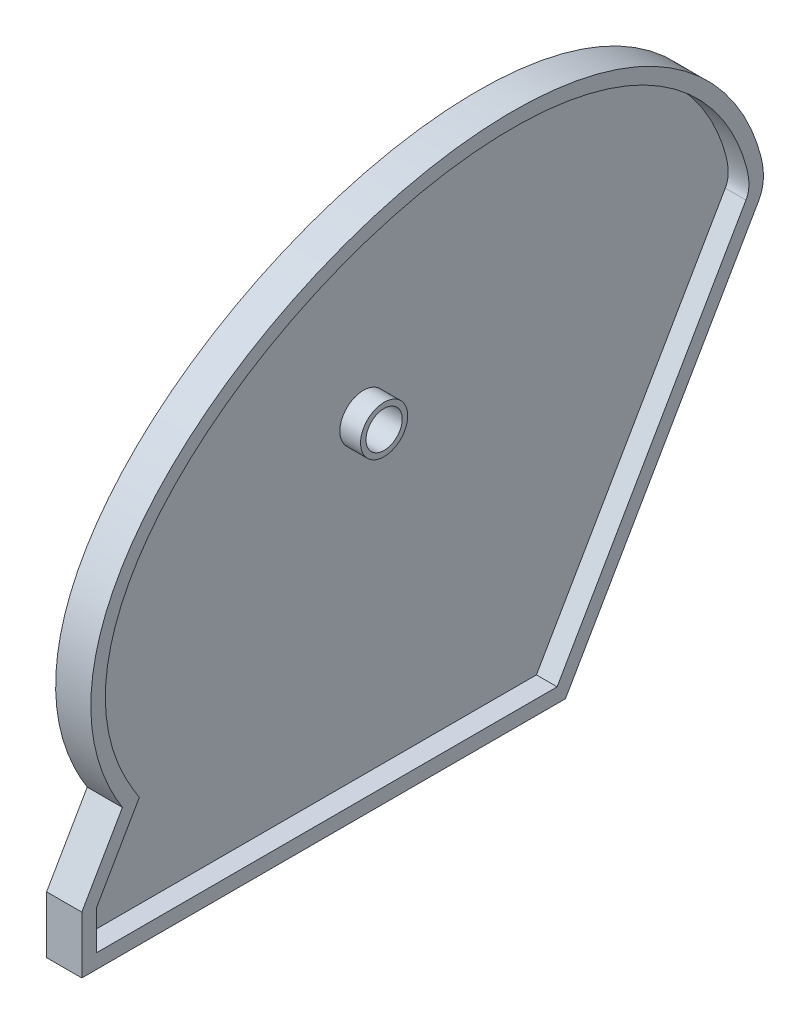
ISO-10303-21;
HEADER;
FILE_DESCRIPTION(('STEP AP214'),'2;1');
FILE_NAME('part.step','',(''),(''),'','','');
FILE_SCHEMA(('AUTOMOTIVE_DESIGN { 1 0 10303 214 1 1 1 1 }'));
ENDSEC;
DATA;
#1=APPLICATION_CONTEXT('core data for automotive mechanical design processes');
#2=APPLICATION_PROTOCOL_DEFINITION('international standard','automotive_design',2000,#1);
#3=PRODUCT_CONTEXT('',#1,'mechanical');
#4=PRODUCT('Part','Part','',(#3));
#5=PRODUCT_RELATED_PRODUCT_CATEGORY('part','',(#4));
#6=PRODUCT_DEFINITION_FORMATION('','',#4);
#7=PRODUCT_DEFINITION_CONTEXT('part definition',#1,'design');
#8=PRODUCT_DEFINITION('design','',#6,#7);
#9=PRODUCT_DEFINITION_SHAPE('','',#8);
#10=(LENGTH_UNIT() NAMED_UNIT(*) SI_UNIT(.MILLI.,.METRE.));
#11=(NAMED_UNIT(*) PLANE_ANGLE_UNIT() SI_UNIT($,.RADIAN.));
#12=(NAMED_UNIT(*) SI_UNIT($,.STERADIAN.) SOLID_ANGLE_UNIT());
#13=UNCERTAINTY_MEASURE_WITH_UNIT(LENGTH_MEASURE(1.E-05),#10,'distance_accuracy_value','');
#14=(GEOMETRIC_REPRESENTATION_CONTEXT(3) GLOBAL_UNCERTAINTY_ASSIGNED_CONTEXT((#13)) GLOBAL_UNIT_ASSIGNED_CONTEXT((#10,
#11,#12)) REPRESENTATION_CONTEXT('',''));
#15=CARTESIAN_POINT('',(0.,0.,0.));
#16=DIRECTION('',(0.,0.,1.));
#17=DIRECTION('',(1.,0.,0.));
#18=AXIS2_PLACEMENT_3D('',#15,#16,#17);
#19=CARTESIAN_POINT('',(0.,71.0497399033929,29.494866598734));
#20=DIRECTION('',(1.,0.,0.));
#21=DIRECTION('',(0.,0.,-1.));
#22=AXIS2_PLACEMENT_3D('',#19,#20,#21);
#23=PLANE('',#22);
#24=DIRECTION('',(0.,0.866025403784436,-0.500000000000004));
#25=VECTOR('',#24,1.);
#26=CARTESIAN_POINT('',(0.,0.,0.));
#27=LINE('',#26,#25);
#28=CARTESIAN_POINT('',(0.,0.,0.));
#29=VERTEX_POINT('',#28);
#30=CARTESIAN_POINT('',(0.,46.8317093502895,-27.0383000000002));
#31=VERTEX_POINT('',#30);
#32=EDGE_CURVE('E134',#29,#31,#27,.T.);
#33=ORIENTED_EDGE('',*,*,#32,.F.);
#34=DIRECTION('',(0.,0.,-1.));
#35=VECTOR('',#34,1.);
#36=CARTESIAN_POINT('',(0.,0.,0.));
#37=LINE('',#36,#35);
#38=CARTESIAN_POINT('',(0.,0.,67.7418));
#39=VERTEX_POINT('',#38);
#40=EDGE_CURVE('E92',#39,#29,#37,.T.);
#41=ORIENTED_EDGE('',*,*,#40,.F.);
#42=DIRECTION('',(0.,-1.,0.));
#43=VECTOR('',#42,1.);
#44=CARTESIAN_POINT('',(0.,0.,67.7418));
#45=LINE('',#44,#43);
#46=CARTESIAN_POINT('',(0.,7.99037948552133,67.7418));
#47=VERTEX_POINT('',#46);
#48=EDGE_CURVE('E149',#47,#39,#45,.T.);
#49=ORIENTED_EDGE('',*,*,#48,.F.);
#50=DIRECTION('',(0.,-0.866025403784437,0.500000000000004));
#51=VECTOR('',#50,1.);
#52=CARTESIAN_POINT('',(0.,7.99037948552133,67.7418));
#53=LINE('',#52,#51);
#54=CARTESIAN_POINT('',(0.,17.8441334348336,62.0527325048362));
#55=VERTEX_POINT('',#54);
#56=EDGE_CURVE('E120',#55,#47,#53,.T.);
#57=ORIENTED_EDGE('',*,*,#56,.F.);
#58=CARTESIAN_POINT('',(0.,46.8317093502895,-27.0383000000002));
#59=CARTESIAN_POINT('',(0.,48.7627183340828,-28.1531685566009));
#60=CARTESIAN_POINT('',(0.,59.7977207325361,-26.0937287249918));
#61=CARTESIAN_POINT('',(0.,94.4521354905036,7.19689613873375));
#62=CARTESIAN_POINT('',(0.,52.1816989014148,83.5204524046725));
#63=CARTESIAN_POINT('',(0.,17.8441334348336,62.0527325048362));
#64=B_SPLINE_CURVE_WITH_KNOTS('',3,(#58,#59,#60,#61,#62,#63),.UNSPECIFIED.,.F.,.F.,(4,1,1,4),
(0.,0.0480389012298618,0.22766527146338,1.),.UNSPECIFIED.);
#65=EDGE_CURVE('E138',#31,#55,#64,.T.);
#66=ORIENTED_EDGE('',*,*,#65,.F.);
#67=EDGE_LOOP('',(#33,#41,#49,#57,#66));
#68=FACE_BOUND('',#67,.T.);
#69=CARTESIAN_POINT('',(0.,45.3644,25.4));
#70=DIRECTION('',(-1.,0.,0.));
#71=DIRECTION('',(0.,0.,1.));
#72=AXIS2_PLACEMENT_3D('',#69,#70,#71);
#73=CIRCLE('',#72,3.81);
#74=CARTESIAN_POINT('',(0.,45.3644,29.21));
#75=VERTEX_POINT('',#74);
#76=EDGE_CURVE('E437',#75,#75,#73,.T.);
#77=ORIENTED_EDGE('',*,*,#76,.F.);
#78=EDGE_LOOP('',(#77));
#79=FACE_BOUND('',#78,.T.);
#80=ADVANCED_FACE('F43',(#68,#79),#23,.F.);
#81=CARTESIAN_POINT('',(4.9276,71.0497399033929,29.494866598734));
#82=DIRECTION('',(1.,0.,0.));
#83=DIRECTION('',(0.,0.,-1.));
#84=AXIS2_PLACEMENT_3D('',#81,#82,#83);
#85=PLANE('',#84);
#86=CARTESIAN_POINT('',(4.9276,45.3644,25.4));
#87=DIRECTION('',(-1.,0.,0.));
#88=DIRECTION('',(0.,0.,1.));
#89=AXIS2_PLACEMENT_3D('',#86,#87,#88);
#90=CIRCLE('',#89,2.54);
#91=CARTESIAN_POINT('',(4.9276,45.3644,27.94));
#92=VERTEX_POINT('',#91);
#93=EDGE_CURVE('E215',#92,#92,#90,.T.);
#94=ORIENTED_EDGE('',*,*,#93,.T.);
#95=EDGE_LOOP('',(#94));
#96=FACE_BOUND('',#95,.T.);
#97=CARTESIAN_POINT('',(4.9276,45.3644,25.4));
#98=DIRECTION('',(1.,0.,0.));
#99=DIRECTION('',(0.,0.,-1.));
#100=AXIS2_PLACEMENT_3D('',#97,#98,#99);
#101=CIRCLE('',#100,3.302);
#102=CARTESIAN_POINT('',(4.9276,45.3644,22.098));
#103=VERTEX_POINT('',#102);
#104=EDGE_CURVE('E170',#103,#103,#101,.T.);
#105=ORIENTED_EDGE('',*,*,#104,.T.);
#106=EDGE_LOOP('',(#105));
#107=FACE_BOUND('',#106,.T.);
#108=ADVANCED_FACE('F270',(#96,#107),#85,.T.);
#109=DIRECTION('',(0.,0.866025403784436,-0.500000000000004));
#110=VECTOR('',#109,1.);
#111=CARTESIAN_POINT('',(4.9276,1.01600000000001,1.75976362048997));
#112=LINE('',#111,#110);
#113=CARTESIAN_POINT('',(4.9276,2.032,1.17317574699331));
#114=VERTEX_POINT('',#113);
#115=CARTESIAN_POINT('',(4.9276,47.8477093502895,-25.2785363795102));
#116=VERTEX_POINT('',#115);
#117=EDGE_CURVE('E197',#114,#116,#112,.T.);
#118=ORIENTED_EDGE('',*,*,#117,.F.);
#119=DIRECTION('',(0.,0.,-1.));
#120=VECTOR('',#119,1.);
#121=CARTESIAN_POINT('',(4.9276,2.032,0.));
#122=LINE('',#121,#120);
#123=CARTESIAN_POINT('',(4.9276,2.03199999999999,65.7098));
#124=VERTEX_POINT('',#123);
#125=EDGE_CURVE('E176',#124,#114,#122,.T.);
#126=ORIENTED_EDGE('',*,*,#125,.F.);
#127=DIRECTION('',(0.,-1.,0.));
#128=VECTOR('',#127,1.);
#129=CARTESIAN_POINT('',(4.9276,0.,65.7098));
#130=LINE('',#129,#128);
#131=CARTESIAN_POINT('',(4.9276,7.44590672650129,65.7098));
#132=VERTEX_POINT('',#131);
#133=EDGE_CURVE('E180',#132,#124,#130,.T.);
#134=ORIENTED_EDGE('',*,*,#133,.F.);
#135=DIRECTION('',(0.,-0.866025403784436,0.500000000000004));
#136=VECTOR('',#135,1.);
#137=CARTESIAN_POINT('',(4.9276,6.97437948552132,65.98203637951));
#138=LINE('',#137,#136);
#139=CARTESIAN_POINT('',(4.9276,17.8857876844654,59.6823319186117));
#140=VERTEX_POINT('',#139);
#141=EDGE_CURVE('E183',#140,#132,#138,.T.);
#142=ORIENTED_EDGE('',*,*,#141,.F.);
#143=CARTESIAN_POINT('',(4.9276,47.8477093502895,-25.2785363795102));
#144=CARTESIAN_POINT('',(4.9276,47.8882196500267,-25.3019304614528));
#145=CARTESIAN_POINT('',(4.9276,47.9293132893911,-25.3243001320153));
#146=CARTESIAN_POINT('',(4.9276,48.0125678720624,-25.3669420802811));
#147=CARTESIAN_POINT('',(4.9276,48.054728673025,-25.3872146358939));
#148=CARTESIAN_POINT('',(4.9276,48.1824485460611,-25.4447188718725));
#149=CARTESIAN_POINT('',(4.9276,48.2694651414573,-25.4787640658195));
#150=CARTESIAN_POINT('',(4.9276,48.4443440957077,-25.5377807698905));
#151=CARTESIAN_POINT('',(4.9276,48.5321454043849,-25.5629359528445));
#152=CARTESIAN_POINT('',(4.9276,48.7095843121599,-25.6057962288146));
#153=CARTESIAN_POINT('',(4.9276,48.7992230960672,-25.6234963454969));
#154=CARTESIAN_POINT('',(4.9276,49.0221846067859,-25.6589923856093));
#155=CARTESIAN_POINT('',(4.9276,49.1561274067822,-25.6728786043546));
#156=CARTESIAN_POINT('',(4.9276,49.4246922642192,-25.6887374697185));
#157=CARTESIAN_POINT('',(4.9276,49.5593146663758,-25.6907032971262));
#158=CARTESIAN_POINT('',(4.9276,49.829934810389,-25.6849493805812));
#159=CARTESIAN_POINT('',(4.9276,49.9659295652127,-25.6771125756812));
#160=CARTESIAN_POINT('',(4.9276,50.2371429069821,-25.6534537170028));
#161=CARTESIAN_POINT('',(4.9276,50.3723617385062,-25.6376343371126));
#162=CARTESIAN_POINT('',(4.9276,50.6244710611065,-25.6019721024329));
#163=CARTESIAN_POINT('',(4.9276,50.7414751163399,-25.5829118272578));
#164=CARTESIAN_POINT('',(4.9276,50.9747417019682,-25.5406639638183));
#165=CARTESIAN_POINT('',(4.9276,51.0910041423123,-25.5174758838566));
#166=CARTESIAN_POINT('',(4.9276,51.4389647777242,-25.4426873345054));
#167=CARTESIAN_POINT('',(4.9276,51.6695480229144,-25.3859068133216));
#168=CARTESIAN_POINT('',(4.9276,52.1284830253991,-25.2626191354283));
#169=CARTESIAN_POINT('',(4.9276,52.3568298312633,-25.1960940739529));
#170=CARTESIAN_POINT('',(4.9276,52.697897171801,-25.091499082647));
#171=CARTESIAN_POINT('',(4.9276,52.8113630740847,-25.0558264575209));
#172=CARTESIAN_POINT('',(4.9276,53.0378075421948,-24.9829693902236));
#173=CARTESIAN_POINT('',(4.9276,53.1507861143097,-24.9457849676259));
#174=CARTESIAN_POINT('',(4.9276,53.4893410967263,-24.8318057215938));
#175=CARTESIAN_POINT('',(4.9276,53.7141458922253,-24.752704802578));
#176=CARTESIAN_POINT('',(4.9276,54.1611692771795,-24.5885371066265));
#177=CARTESIAN_POINT('',(4.9276,54.3833913225373,-24.5034797253481));
#178=CARTESIAN_POINT('',(4.9276,54.8252550075334,-24.3273974706786));
#179=CARTESIAN_POINT('',(4.9276,55.044898566582,-24.236377418333));
#180=CARTESIAN_POINT('',(4.9276,55.4816002405753,-24.0483711530193));
#181=CARTESIAN_POINT('',(4.9276,55.6986584813652,-23.9513852318793));
#182=CARTESIAN_POINT('',(4.9276,56.2491516149999,-23.6963131513505));
#183=CARTESIAN_POINT('',(4.9276,56.580666645579,-23.5340595886507));
#184=CARTESIAN_POINT('',(4.9276,57.2367957987768,-23.1954587601684));
#185=CARTESIAN_POINT('',(4.9276,57.561403277643,-23.0190986392068));
#186=CARTESIAN_POINT('',(4.9276,58.2030014299524,-22.6526758724147));
#187=CARTESIAN_POINT('',(4.9276,58.5199883201009,-22.462606600529));
#188=CARTESIAN_POINT('',(4.9276,59.1456606770651,-22.0692416962304));
#189=CARTESIAN_POINT('',(4.9276,59.4543458324941,-21.8659455686714));
#190=CARTESIAN_POINT('',(4.9276,60.0618457493463,-21.447320626459));
#191=CARTESIAN_POINT('',(4.9276,60.3606913777572,-21.2320365947444));
#192=CARTESIAN_POINT('',(4.9276,60.9491187892709,-20.7893346855484));
#193=CARTESIAN_POINT('',(4.9276,61.2387031975462,-20.5619202961681));
#194=CARTESIAN_POINT('',(4.9276,61.8082649124347,-20.0954416476159));
#195=CARTESIAN_POINT('',(4.9276,62.0882435324747,-19.8563789920503));
#196=CARTESIAN_POINT('',(4.9276,62.6382652107207,-19.367124267479));
#197=CARTESIAN_POINT('',(4.9276,62.9083087189238,-19.1169327036787));
#198=CARTESIAN_POINT('',(4.9276,63.5298726053719,-18.5175105067685));
#199=CARTESIAN_POINT('',(4.9276,63.8772495568019,-18.1639684335733));
#200=CARTESIAN_POINT('',(4.9276,64.5528530564373,-17.439000718162));
#201=CARTESIAN_POINT('',(4.9276,64.8810776410541,-17.0675732493535));
#202=CARTESIAN_POINT('',(4.9276,65.5178430221505,-16.3082017252172));
#203=CARTESIAN_POINT('',(4.9276,65.8263832899815,-15.9202572267687));
#204=CARTESIAN_POINT('',(4.9276,66.4238687136188,-15.1285248863508));
#205=CARTESIAN_POINT('',(4.9276,66.7127792457059,-14.7247109363693));
#206=CARTESIAN_POINT('',(4.9276,67.2700942256335,-13.9031998828609));
#207=CARTESIAN_POINT('',(4.9276,67.5384993560003,-13.4855032420868));
#208=CARTESIAN_POINT('',(4.9276,68.0545653750984,-12.6374990285577));
#209=CARTESIAN_POINT('',(4.9276,68.3022262158042,-12.2071914266098));
#210=CARTESIAN_POINT('',(4.9276,68.8000121235877,-11.292241354939));
#211=CARTESIAN_POINT('',(4.9276,69.0479765317437,-10.80642219292));
#212=CARTESIAN_POINT('',(4.9276,69.5184636272543,-9.82259626346141));
#213=CARTESIAN_POINT('',(4.9276,69.740984533598,-9.32458864580475));
#214=CARTESIAN_POINT('',(4.9276,70.1610449690003,-8.31818443617228));
#215=CARTESIAN_POINT('',(4.9276,70.3585851819069,-7.80978812903022));
#216=CARTESIAN_POINT('',(4.9276,70.7294043817274,-6.7843287430416));
#217=CARTESIAN_POINT('',(4.9276,70.9026868552154,-6.2672669216795));
#218=CARTESIAN_POINT('',(4.9276,71.2258442549759,-5.22588428887193));
#219=CARTESIAN_POINT('',(4.9276,71.3757187913432,-4.70156335667));
#220=CARTESIAN_POINT('',(4.9276,71.652955826507,-3.64696238112609));
#221=CARTESIAN_POINT('',(4.9276,71.7803152387171,-3.11668153132375));
#222=CARTESIAN_POINT('',(4.9276,72.0872660471482,-1.71388613934154));
#223=CARTESIAN_POINT('',(4.9276,72.2488330871903,-0.837383536975913));
#224=CARTESIAN_POINT('',(4.9276,72.5182789992319,0.92410037732526));
#225=CARTESIAN_POINT('',(4.9276,72.6261325496709,1.80908548808854));
#226=CARTESIAN_POINT('',(4.9276,72.7918527535424,3.58379117241054));
#227=CARTESIAN_POINT('',(4.9276,72.8497125020623,4.47351238302852));
#228=CARTESIAN_POINT('',(4.9276,72.9189835354734,6.25703106634076));
#229=CARTESIAN_POINT('',(4.9276,72.9302727192097,7.15083311132649));
#230=CARTESIAN_POINT('',(4.9276,72.90921573728,8.93770954356539));
#231=CARTESIAN_POINT('',(4.9276,72.8768780391159,9.83078403836834));
#232=CARTESIAN_POINT('',(4.9276,72.7713455896747,11.6145361163523));
#233=CARTESIAN_POINT('',(4.9276,72.6981470303228,12.5052134683537));
#234=CARTESIAN_POINT('',(4.9276,72.4709529350111,14.6898665072708));
#235=CARTESIAN_POINT('',(4.9276,72.2953036508987,15.9816259260854));
#236=CARTESIAN_POINT('',(4.9276,71.8684166738655,18.5529220905937));
#237=CARTESIAN_POINT('',(4.9276,71.6171507052931,19.8324540790504));
#238=CARTESIAN_POINT('',(4.9276,71.0438028465201,22.375768134355));
#239=CARTESIAN_POINT('',(4.9276,70.7217072335393,23.639547098952));
#240=CARTESIAN_POINT('',(4.9276,70.0094503062011,26.1511843564121));
#241=CARTESIAN_POINT('',(4.9276,69.6191190051185,27.3989943336485));
#242=CARTESIAN_POINT('',(4.9276,68.7736075859176,29.8721207070256));
#243=CARTESIAN_POINT('',(4.9276,68.3184419154747,31.0974420460416));
#244=CARTESIAN_POINT('',(4.9276,67.3448199847308,33.5225753857054));
#245=CARTESIAN_POINT('',(4.9276,66.8263682383481,34.7223891985341));
#246=CARTESIAN_POINT('',(4.9276,65.7136190952127,37.1214932308276));
#247=CARTESIAN_POINT('',(4.9276,65.1177983197531,38.3200778377063));
#248=CARTESIAN_POINT('',(4.9276,63.8602082851313,40.682406967215));
#249=CARTESIAN_POINT('',(4.9276,63.1984303551433,41.8461468828903));
#250=CARTESIAN_POINT('',(4.9276,61.807501983816,44.1336744943577));
#251=CARTESIAN_POINT('',(4.9276,61.0783109380297,45.2574375394758));
#252=CARTESIAN_POINT('',(4.9276,59.5545964230383,47.4519129989326));
#253=CARTESIAN_POINT('',(4.9276,58.7604116950542,48.522859020048));
#254=CARTESIAN_POINT('',(4.9276,57.5161815195275,50.0865943926369));
#255=CARTESIAN_POINT('',(4.9276,57.0926808622762,50.6006508384792));
#256=CARTESIAN_POINT('',(4.9276,56.2275519049596,51.6132512201227));
#257=CARTESIAN_POINT('',(4.9276,55.7859251522777,52.1117964737177));
#258=CARTESIAN_POINT('',(4.9276,54.8845885814528,53.0913031770884));
#259=CARTESIAN_POINT('',(4.9276,54.4248985848493,53.5722828421378));
#260=CARTESIAN_POINT('',(4.9276,53.4866095200043,54.5153607547004));
#261=CARTESIAN_POINT('',(4.9276,53.0080119865918,54.9774605286292));
#262=CARTESIAN_POINT('',(4.9276,51.8837969403899,56.0173263172635));
#263=CARTESIAN_POINT('',(4.9276,51.2314213526092,56.5878354175163));
#264=CARTESIAN_POINT('',(4.9276,49.8931072090801,57.6879591842049));
#265=CARTESIAN_POINT('',(4.9276,49.2071723207499,58.2175783029329));
#266=CARTESIAN_POINT('',(4.9276,47.8015382040626,59.2293203959221));
#267=CARTESIAN_POINT('',(4.9276,47.0818617762922,59.7114747802288));
#268=CARTESIAN_POINT('',(4.9276,45.9771392661627,60.3935350687628));
#269=CARTESIAN_POINT('',(4.9276,45.6047065968707,60.6140216957256));
#270=CARTESIAN_POINT('',(4.9276,44.8513983770195,61.0403190504889));
#271=CARTESIAN_POINT('',(4.9276,44.4705206038935,61.2461258533151));
#272=CARTESIAN_POINT('',(4.9276,43.4293957195192,61.7812933140173));
#273=CARTESIAN_POINT('',(4.9276,42.7612995685422,62.0955973099432));
#274=CARTESIAN_POINT('',(4.9276,41.4032103030159,62.6722501407504));
#275=CARTESIAN_POINT('',(4.9276,40.71322285564,62.9346122969311));
#276=CARTESIAN_POINT('',(4.9276,39.3141205848137,63.4013771904326));
#277=CARTESIAN_POINT('',(4.9276,38.6050177792742,63.6058154551098));
#278=CARTESIAN_POINT('',(4.9276,37.5300371365841,63.8648451768973));
#279=CARTESIAN_POINT('',(4.9276,37.1697756920791,63.9432574565455));
#280=CARTESIAN_POINT('',(4.9276,36.4460541044175,64.0836052385253));
#281=CARTESIAN_POINT('',(4.9276,36.0825941008772,64.1455414563839));
#282=CARTESIAN_POINT('',(4.9276,35.2271959042045,64.2708288892559));
#283=CARTESIAN_POINT('',(4.9276,34.7342299916146,64.3272840181481));
#284=CARTESIAN_POINT('',(4.9276,33.7456555583689,64.4083282264217));
#285=CARTESIAN_POINT('',(4.9276,33.250046872051,64.4329152840062));
#286=CARTESIAN_POINT('',(4.9276,32.2582857651989,64.4496229252956));
#287=CARTESIAN_POINT('',(4.9276,31.762133360711,64.441744442634));
#288=CARTESIAN_POINT('',(4.9276,30.7716933036198,64.393427712293));
#289=CARTESIAN_POINT('',(4.9276,30.2774047709576,64.3530074869045));
#290=CARTESIAN_POINT('',(4.9276,29.2925112122545,64.2400311291956));
#291=CARTESIAN_POINT('',(4.9276,28.801906288741,64.167474105746));
#292=CARTESIAN_POINT('',(4.9276,27.8264567650211,63.9911214052262));
#293=CARTESIAN_POINT('',(4.9276,27.3416109815577,63.8873322645917));
#294=CARTESIAN_POINT('',(4.9276,26.4432646226024,63.6655959325871));
#295=CARTESIAN_POINT('',(4.9276,26.0288409083065,63.5513599508277));
#296=CARTESIAN_POINT('',(4.9276,25.2065520503051,63.3014277370426));
#297=CARTESIAN_POINT('',(4.9276,24.7986864794959,63.165732908827));
#298=CARTESIAN_POINT('',(4.9276,23.9902448608013,62.8740336610131));
#299=CARTESIAN_POINT('',(4.9276,23.5896697328671,62.7180266982861));
#300=CARTESIAN_POINT('',(4.9276,22.7962348416185,62.3868651249884));
#301=CARTESIAN_POINT('',(4.9276,22.403380057481,62.2116986066955));
#302=CARTESIAN_POINT('',(4.9276,21.6261504181519,61.8436095959781));
#303=CARTESIAN_POINT('',(4.9276,21.2417747112392,61.6506888971175));
#304=CARTESIAN_POINT('',(4.9276,20.4819151465692,61.2484376819188));
#305=CARTESIAN_POINT('',(4.9276,20.1064275204041,61.0391142884231));
#306=CARTESIAN_POINT('',(4.9276,19.6310810382814,60.7611873394814));
#307=CARTESIAN_POINT('',(4.9276,19.5270882582079,60.6995762277652));
#308=CARTESIAN_POINT('',(4.9276,19.3716325525203,60.6062795568202));
#309=CARTESIAN_POINT('',(4.9276,19.319905244885,60.5750354462762));
#310=CARTESIAN_POINT('',(4.9276,19.2166284688866,60.5122552721556));
#311=CARTESIAN_POINT('',(4.9276,19.1650789999545,60.4807192095143));
#312=CARTESIAN_POINT('',(4.9276,19.0621530985211,60.4173631880997));
#313=CARTESIAN_POINT('',(4.9276,19.0107766699374,60.385543222958));
#314=CARTESIAN_POINT('',(4.9276,18.9338527622693,60.3375875402002));
#315=CARTESIAN_POINT('',(4.9276,18.9082348500044,60.3215646486886));
#316=CARTESIAN_POINT('',(4.9276,18.8569952924664,60.2895248355987));
#317=CARTESIAN_POINT('',(4.9276,18.8313736471917,60.273507914023));
#318=CARTESIAN_POINT('',(4.9276,18.7546417561447,60.2255380464922));
#319=CARTESIAN_POINT('',(4.9276,18.7035325240695,60.1935834725372));
#320=CARTESIAN_POINT('',(4.9276,18.6013133635968,60.1296754654054));
#321=CARTESIAN_POINT('',(4.9276,18.5502034351994,60.0977220322283));
#322=CARTESIAN_POINT('',(4.9276,18.396874085461,60.0018616109093));
#323=CARTESIAN_POINT('',(4.9276,18.2946548407194,59.9379543391483));
#324=CARTESIAN_POINT('',(4.9276,18.0902197039564,59.810141891752));
#325=CARTESIAN_POINT('',(4.9276,17.9880038119351,59.7462367161166));
#326=CARTESIAN_POINT('',(4.9276,17.8857876844654,59.6823319186117));
#327=B_SPLINE_CURVE_WITH_KNOTS('',3,(#143,#144,#145,#146,#147,#148,#149,#150,#151,#152,#153,
#154,#155,#156,#157,#158,#159,#160,#161,#162,#163,#164,#165,#166,#167,#168,#169,#170,#171,#172,
#173,#174,#175,#176,#177,#178,#179,#180,#181,#182,#183,#184,#185,#186,#187,#188,#189,#190,#191,
#192,#193,#194,#195,#196,#197,#198,#199,#200,#201,#202,#203,#204,#205,#206,#207,#208,#209,#210,
#211,#212,#213,#214,#215,#216,#217,#218,#219,#220,#221,#222,#223,#224,#225,#226,#227,#228,#229,
#230,#231,#232,#233,#234,#235,#236,#237,#238,#239,#240,#241,#242,#243,#244,#245,#246,#247,#248,
#249,#250,#251,#252,#253,#254,#255,#256,#257,#258,#259,#260,#261,#262,#263,#264,#265,#266,#267,
#268,#269,#270,#271,#272,#273,#274,#275,#276,#277,#278,#279,#280,#281,#282,#283,#284,#285,#286,
#287,#288,#289,#290,#291,#292,#293,#294,#295,#296,#297,#298,#299,#300,#301,#302,#303,#304,#305,
#306,#307,#308,#309,#310,#311,#312,#313,#314,#315,#316,#317,#318,#319,#320,#321,#322,#323,#324,
#325,#326),.UNSPECIFIED.,.F.,.F.,(4,2,2,2,2,2,2,2,2,2,2,2,2,2,2,2,2,2,2,2,2,2,2,2,2,2,2,2,2,2,2,
2,2,2,2,2,2,2,2,2,2,2,2,2,2,2,2,2,2,2,2,2,2,2,2,2,2,2,2,2,2,2,2,2,2,2,2,2,2,2,2,2,2,2,2,2,2,2,2,
2,2,2,2,2,2,2,2,2,2,2,2,4),(0.,0.140310966179463,0.280603314480304,0.560429404165115,
0.834079749496183,1.10791247087116,1.51118566995544,1.91468954483032,2.32305830998289,
2.73129037635593,3.08684534368353,3.44244269249289,4.15451071325339,4.86790390355454,
5.22472036697534,5.58153221212268,6.2963820469172,7.01012863688692,7.72330509317159,
8.4364466912193,9.5433654217124,10.6513046280821,11.7597829711775,12.8683028339427,
13.9729282031429,15.0772376304117,16.1813954556001,17.2855032077469,18.7716939920833,
20.2580368807554,21.7444196703561,23.2333595666001,24.7222498815703,26.2111436434039,
27.8467100828765,29.4823909398174,31.1180270102005,32.7534277480874,34.3888557238919,
36.0245077260819,38.6963625401067,41.3694757278353,44.0429580545939,46.7234454201434,
49.4034126071616,52.0836295984921,55.9920019351487,59.9018375650219,63.812431368412,
67.7329096858451,71.6525157276104,75.5718423642376,79.5853645013851,83.5994149598272,
87.615899122756,91.6126413171585,93.6104064782977,95.6080014480523,97.6034624514042,
99.5987618036994,102.197163327482,104.795281524984,107.391668680085,108.689798344297,
109.988273801045,112.201168301204,114.41349453257,116.624460891648,117.730227097853,
118.835945274705,120.323465262808,121.811079618602,123.298651194363,124.78539948845,
126.272189011523,127.75866758695,129.047720012493,130.33668814474,131.6258178144,
132.915753284142,134.205558584695,135.494806860737,135.857423752713,136.038715640373,
136.220006947416,136.401302331487,136.491950488884,136.582598686377,136.763427980077,
136.944257238127,137.305914838389,137.667560576516),.UNSPECIFIED.);
#328=EDGE_CURVE('E187',#116,#140,#327,.T.);
#329=ORIENTED_EDGE('',*,*,#328,.F.);
#330=EDGE_LOOP('',(#118,#126,#134,#142,#329));
#331=FACE_BOUND('',#330,.T.);
#332=DIRECTION('',(0.,0.866025403784436,-0.500000000000004));
#333=VECTOR('',#332,1.);
#334=CARTESIAN_POINT('',(4.9276,0.,0.));
#335=LINE('',#334,#333);
#336=CARTESIAN_POINT('',(4.9276,0.,0.));
#337=VERTEX_POINT('',#336);
#338=CARTESIAN_POINT('',(4.9276,46.8317093502895,-27.0383000000002));
#339=VERTEX_POINT('',#338);
#340=EDGE_CURVE('E154',#337,#339,#335,.T.);
#341=ORIENTED_EDGE('',*,*,#340,.T.);
#342=CARTESIAN_POINT('',(4.9276,46.8317093502895,-27.0383000000002));
#343=CARTESIAN_POINT('',(4.9276,48.7627183340828,-28.1531685566009));
#344=CARTESIAN_POINT('',(4.9276,59.7977207325361,-26.0937287249918));
#345=CARTESIAN_POINT('',(4.9276,94.4521354905036,7.19689613873375));
#346=CARTESIAN_POINT('',(4.9276,52.1816989014148,83.5204524046725));
#347=CARTESIAN_POINT('',(4.9276,17.8441334348336,62.0527325048362));
#348=CARTESIAN_POINT('',(4.9276,17.3995390873588,61.7747737505987));
#349=CARTESIAN_POINT('',(4.9276,16.9549447398841,61.4968149963613));
#350=CARTESIAN_POINT('',(4.9276,16.5103503924094,61.2188562421238));
#351=B_SPLINE_CURVE_WITH_KNOTS('',3,(#342,#343,#344,#345,#346,#347,#348,#349,#350),
.UNSPECIFIED.,.F.,.F.,(4,1,1,3,4),(0.,0.0480389012298618,0.22766527146338,1.,1.01),.UNSPECIFIED.);
#352=CARTESIAN_POINT('',(4.9276,17.8441334348336,62.0527325048362));
#353=VERTEX_POINT('',#352);
#354=EDGE_CURVE('E100',#339,#353,#351,.T.);
#355=ORIENTED_EDGE('',*,*,#354,.T.);
#356=DIRECTION('',(0.,-0.866025403784437,0.500000000000004));
#357=VECTOR('',#356,1.);
#358=CARTESIAN_POINT('',(4.9276,7.99037948552133,67.7418));
#359=LINE('',#358,#357);
#360=CARTESIAN_POINT('',(4.9276,7.99037948552133,67.7418));
#361=VERTEX_POINT('',#360);
#362=EDGE_CURVE('E106',#353,#361,#359,.T.);
#363=ORIENTED_EDGE('',*,*,#362,.T.);
#364=DIRECTION('',(0.,-1.,0.));
#365=VECTOR('',#364,1.);
#366=CARTESIAN_POINT('',(4.9276,0.,67.7418));
#367=LINE('',#366,#365);
#368=CARTESIAN_POINT('',(4.9276,0.,67.7418));
#369=VERTEX_POINT('',#368);
#370=EDGE_CURVE('E110',#361,#369,#367,.T.);
#371=ORIENTED_EDGE('',*,*,#370,.T.);
#372=DIRECTION('',(0.,0.,-1.));
#373=VECTOR('',#372,1.);
#374=CARTESIAN_POINT('',(4.9276,0.,0.));
#375=LINE('',#374,#373);
#376=EDGE_CURVE('E68',#369,#337,#375,.T.);
#377=ORIENTED_EDGE('',*,*,#376,.T.);
#378=EDGE_LOOP('',(#341,#355,#363,#371,#377));
#379=FACE_BOUND('',#378,.T.);
#380=ADVANCED_FACE('F108',(#331,#379),#85,.T.);
#381=CARTESIAN_POINT('',(4.9276,0.,0.));
#382=DIRECTION('',(0.,0.500000000000004,0.866025403784436));
#383=DIRECTION('',(0.,-0.866025403784436,0.500000000000004));
#384=AXIS2_PLACEMENT_3D('',#381,#382,#383);
#385=PLANE('',#384);
#386=ORIENTED_EDGE('',*,*,#32,.T.);
#387=DIRECTION('',(-1.,0.,0.));
#388=VECTOR('',#387,1.);
#389=CARTESIAN_POINT('',(4.9276,46.8317093502895,-27.0383000000002));
#390=LINE('',#389,#388);
#391=EDGE_CURVE('E11',#339,#31,#390,.T.);
#392=ORIENTED_EDGE('',*,*,#391,.F.);
#393=ORIENTED_EDGE('',*,*,#340,.F.);
#394=DIRECTION('',(-1.,0.,0.));
#395=VECTOR('',#394,1.);
#396=CARTESIAN_POINT('',(4.9276,0.,0.));
#397=LINE('',#396,#395);
#398=EDGE_CURVE('E130',#337,#29,#397,.T.);
#399=ORIENTED_EDGE('',*,*,#398,.T.);
#400=EDGE_LOOP('',(#386,#392,#393,#399));
#401=FACE_BOUND('',#400,.T.);
#402=ADVANCED_FACE('F45',(#401),#385,.F.);
#403=DIRECTION('',(-1.,0.,0.));
#404=VECTOR('',#403,1.);
#405=SURFACE_OF_LINEAR_EXTRUSION('',#351,#404);
#406=ORIENTED_EDGE('',*,*,#65,.T.);
#407=DIRECTION('',(-1.,0.,0.));
#408=VECTOR('',#407,1.);
#409=CARTESIAN_POINT('',(4.9276,17.8441334348336,62.0527325048362));
#410=LINE('',#409,#408);
#411=EDGE_CURVE('E52',#353,#55,#410,.T.);
#412=ORIENTED_EDGE('',*,*,#411,.F.);
#413=ORIENTED_EDGE('',*,*,#354,.F.);
#414=ORIENTED_EDGE('',*,*,#391,.T.);
#415=EDGE_LOOP('',(#406,#412,#413,#414));
#416=FACE_BOUND('',#415,.T.);
#417=ADVANCED_FACE('F207',(#416),#405,.F.);
#418=CARTESIAN_POINT('',(4.9276,7.99037948552133,67.7418));
#419=DIRECTION('',(0.,-0.500000000000004,-0.866025403784436));
#420=DIRECTION('',(0.,0.866025403784436,-0.500000000000004));
#421=AXIS2_PLACEMENT_3D('',#418,#419,#420);
#422=PLANE('',#421);
#423=ORIENTED_EDGE('',*,*,#56,.T.);
#424=DIRECTION('',(-1.,0.,0.));
#425=VECTOR('',#424,1.);
#426=CARTESIAN_POINT('',(4.9276,7.99037948552133,67.7418));
#427=LINE('',#426,#425);
#428=EDGE_CURVE('E117',#361,#47,#427,.T.);
#429=ORIENTED_EDGE('',*,*,#428,.F.);
#430=ORIENTED_EDGE('',*,*,#362,.F.);
#431=ORIENTED_EDGE('',*,*,#411,.T.);
#432=EDGE_LOOP('',(#423,#429,#430,#431));
#433=FACE_BOUND('',#432,.T.);
#434=ADVANCED_FACE('F118',(#433),#422,.F.);
#435=CARTESIAN_POINT('',(4.9276,0.,67.7418));
#436=DIRECTION('',(0.,0.,-1.));
#437=DIRECTION('',(-1.,0.,0.));
#438=AXIS2_PLACEMENT_3D('',#435,#436,#437);
#439=PLANE('',#438);
#440=ORIENTED_EDGE('',*,*,#48,.T.);
#441=DIRECTION('',(-1.,0.,0.));
#442=VECTOR('',#441,1.);
#443=CARTESIAN_POINT('',(4.9276,0.,67.7418));
#444=LINE('',#443,#442);
#445=EDGE_CURVE('E124',#369,#39,#444,.T.);
#446=ORIENTED_EDGE('',*,*,#445,.F.);
#447=ORIENTED_EDGE('',*,*,#370,.F.);
#448=ORIENTED_EDGE('',*,*,#428,.T.);
#449=EDGE_LOOP('',(#440,#446,#447,#448));
#450=FACE_BOUND('',#449,.T.);
#451=ADVANCED_FACE('F126',(#450),#439,.F.);
#452=CARTESIAN_POINT('',(4.9276,0.,0.));
#453=DIRECTION('',(0.,1.,0.));
#454=DIRECTION('',(0.,0.,1.));
#455=AXIS2_PLACEMENT_3D('',#452,#453,#454);
#456=PLANE('',#455);
#457=ORIENTED_EDGE('',*,*,#40,.T.);
#458=ORIENTED_EDGE('',*,*,#398,.F.);
#459=ORIENTED_EDGE('',*,*,#376,.F.);
#460=ORIENTED_EDGE('',*,*,#445,.T.);
#461=EDGE_LOOP('',(#457,#458,#459,#460));
#462=FACE_BOUND('',#461,.T.);
#463=ADVANCED_FACE('F162',(#462),#456,.F.);
#464=CARTESIAN_POINT('',(2.032,71.0497399033929,29.494866598734));
#465=DIRECTION('',(1.,0.,0.));
#466=DIRECTION('',(0.,0.,-1.));
#467=AXIS2_PLACEMENT_3D('',#464,#465,#466);
#468=PLANE('',#467);
#469=DIRECTION('',(0.,0.866025403784436,-0.500000000000004));
#470=VECTOR('',#469,1.);
#471=CARTESIAN_POINT('',(2.032,1.01600000000001,1.75976362048997));
#472=LINE('',#471,#470);
#473=CARTESIAN_POINT('',(2.032,2.032,1.17317574699331));
#474=VERTEX_POINT('',#473);
#475=CARTESIAN_POINT('',(2.032,47.8477093502895,-25.2785363795102));
#476=VERTEX_POINT('',#475);
#477=EDGE_CURVE('E174',#474,#476,#472,.T.);
#478=ORIENTED_EDGE('',*,*,#477,.T.);
#479=CARTESIAN_POINT('',(2.032,47.8477093502895,-25.2785363795102));
#480=CARTESIAN_POINT('',(2.032,47.8882196500267,-25.3019304614528));
#481=CARTESIAN_POINT('',(2.032,47.9293132893911,-25.3243001320153));
#482=CARTESIAN_POINT('',(2.032,48.0125678720624,-25.3669420802811));
#483=CARTESIAN_POINT('',(2.032,48.054728673025,-25.3872146358939));
#484=CARTESIAN_POINT('',(2.032,48.1824485460611,-25.4447188718725));
#485=CARTESIAN_POINT('',(2.032,48.2694651414573,-25.4787640658195));
#486=CARTESIAN_POINT('',(2.032,48.4443440957077,-25.5377807698905));
#487=CARTESIAN_POINT('',(2.032,48.5321454043849,-25.5629359528445));
#488=CARTESIAN_POINT('',(2.032,48.7095843121599,-25.6057962288146));
#489=CARTESIAN_POINT('',(2.032,48.7992230960672,-25.6234963454969));
#490=CARTESIAN_POINT('',(2.032,49.0221846067859,-25.6589923856093));
#491=CARTESIAN_POINT('',(2.032,49.1561274067822,-25.6728786043546));
#492=CARTESIAN_POINT('',(2.032,49.4246922642192,-25.6887374697185));
#493=CARTESIAN_POINT('',(2.032,49.5593146663758,-25.6907032971262));
#494=CARTESIAN_POINT('',(2.032,49.829934810389,-25.6849493805812));
#495=CARTESIAN_POINT('',(2.032,49.9659295652127,-25.6771125756812));
#496=CARTESIAN_POINT('',(2.032,50.2371429069821,-25.6534537170028));
#497=CARTESIAN_POINT('',(2.032,50.3723617385062,-25.6376343371126));
#498=CARTESIAN_POINT('',(2.032,50.6244710611065,-25.6019721024329));
#499=CARTESIAN_POINT('',(2.032,50.7414751163399,-25.5829118272578));
#500=CARTESIAN_POINT('',(2.032,50.9747417019682,-25.5406639638183));
#501=CARTESIAN_POINT('',(2.032,51.0910041423123,-25.5174758838566));
#502=CARTESIAN_POINT('',(2.032,51.4389647777242,-25.4426873345054));
#503=CARTESIAN_POINT('',(2.032,51.6695480229144,-25.3859068133216));
#504=CARTESIAN_POINT('',(2.032,52.1284830253991,-25.2626191354283));
#505=CARTESIAN_POINT('',(2.032,52.3568298312633,-25.1960940739529));
#506=CARTESIAN_POINT('',(2.032,52.697897171801,-25.091499082647));
#507=CARTESIAN_POINT('',(2.032,52.8113630740847,-25.0558264575209));
#508=CARTESIAN_POINT('',(2.032,53.0378075421948,-24.9829693902236));
#509=CARTESIAN_POINT('',(2.032,53.1507861143097,-24.9457849676259));
#510=CARTESIAN_POINT('',(2.032,53.4893410967263,-24.8318057215938));
#511=CARTESIAN_POINT('',(2.032,53.7141458922253,-24.752704802578));
#512=CARTESIAN_POINT('',(2.032,54.1611692771795,-24.5885371066265));
#513=CARTESIAN_POINT('',(2.032,54.3833913225373,-24.5034797253481));
#514=CARTESIAN_POINT('',(2.032,54.8252550075334,-24.3273974706786));
#515=CARTESIAN_POINT('',(2.032,55.044898566582,-24.236377418333));
#516=CARTESIAN_POINT('',(2.032,55.4816002405753,-24.0483711530193));
#517=CARTESIAN_POINT('',(2.032,55.6986584813652,-23.9513852318793));
#518=CARTESIAN_POINT('',(2.032,56.2491516149999,-23.6963131513505));
#519=CARTESIAN_POINT('',(2.032,56.580666645579,-23.5340595886507));
#520=CARTESIAN_POINT('',(2.032,57.2367957987768,-23.1954587601684));
#521=CARTESIAN_POINT('',(2.032,57.561403277643,-23.0190986392068));
#522=CARTESIAN_POINT('',(2.032,58.2030014299524,-22.6526758724147));
#523=CARTESIAN_POINT('',(2.032,58.5199883201009,-22.462606600529));
#524=CARTESIAN_POINT('',(2.032,59.1456606770651,-22.0692416962304));
#525=CARTESIAN_POINT('',(2.032,59.4543458324941,-21.8659455686714));
#526=CARTESIAN_POINT('',(2.032,60.0618457493463,-21.447320626459));
#527=CARTESIAN_POINT('',(2.032,60.3606913777572,-21.2320365947444));
#528=CARTESIAN_POINT('',(2.032,60.9491187892709,-20.7893346855484));
#529=CARTESIAN_POINT('',(2.032,61.2387031975462,-20.5619202961681));
#530=CARTESIAN_POINT('',(2.032,61.8082649124347,-20.0954416476159));
#531=CARTESIAN_POINT('',(2.032,62.0882435324747,-19.8563789920503));
#532=CARTESIAN_POINT('',(2.032,62.6382652107207,-19.367124267479));
#533=CARTESIAN_POINT('',(2.032,62.9083087189238,-19.1169327036787));
#534=CARTESIAN_POINT('',(2.032,63.5298726053719,-18.5175105067685));
#535=CARTESIAN_POINT('',(2.032,63.8772495568019,-18.1639684335733));
#536=CARTESIAN_POINT('',(2.032,64.5528530564373,-17.439000718162));
#537=CARTESIAN_POINT('',(2.032,64.8810776410541,-17.0675732493535));
#538=CARTESIAN_POINT('',(2.032,65.5178430221505,-16.3082017252172));
#539=CARTESIAN_POINT('',(2.032,65.8263832899815,-15.9202572267687));
#540=CARTESIAN_POINT('',(2.032,66.4238687136188,-15.1285248863508));
#541=CARTESIAN_POINT('',(2.032,66.7127792457059,-14.7247109363693));
#542=CARTESIAN_POINT('',(2.032,67.2700942256335,-13.9031998828609));
#543=CARTESIAN_POINT('',(2.032,67.5384993560003,-13.4855032420868));
#544=CARTESIAN_POINT('',(2.032,68.0545653750984,-12.6374990285577));
#545=CARTESIAN_POINT('',(2.032,68.3022262158042,-12.2071914266098));
#546=CARTESIAN_POINT('',(2.032,68.8000121235877,-11.292241354939));
#547=CARTESIAN_POINT('',(2.032,69.0479765317437,-10.80642219292));
#548=CARTESIAN_POINT('',(2.032,69.5184636272543,-9.82259626346141));
#549=CARTESIAN_POINT('',(2.032,69.740984533598,-9.32458864580475));
#550=CARTESIAN_POINT('',(2.032,70.1610449690003,-8.31818443617228));
#551=CARTESIAN_POINT('',(2.032,70.3585851819069,-7.80978812903022));
#552=CARTESIAN_POINT('',(2.032,70.7294043817274,-6.7843287430416));
#553=CARTESIAN_POINT('',(2.032,70.9026868552154,-6.2672669216795));
#554=CARTESIAN_POINT('',(2.032,71.2258442549759,-5.22588428887193));
#555=CARTESIAN_POINT('',(2.032,71.3757187913432,-4.70156335667));
#556=CARTESIAN_POINT('',(2.032,71.652955826507,-3.64696238112609));
#557=CARTESIAN_POINT('',(2.032,71.7803152387171,-3.11668153132375));
#558=CARTESIAN_POINT('',(2.032,72.0872660471482,-1.71388613934154));
#559=CARTESIAN_POINT('',(2.032,72.2488330871903,-0.837383536975913));
#560=CARTESIAN_POINT('',(2.032,72.5182789992319,0.92410037732526));
#561=CARTESIAN_POINT('',(2.032,72.6261325496709,1.80908548808854));
#562=CARTESIAN_POINT('',(2.032,72.7918527535424,3.58379117241054));
#563=CARTESIAN_POINT('',(2.032,72.8497125020623,4.47351238302852));
#564=CARTESIAN_POINT('',(2.032,72.9189835354734,6.25703106634076));
#565=CARTESIAN_POINT('',(2.032,72.9302727192097,7.15083311132649));
#566=CARTESIAN_POINT('',(2.032,72.90921573728,8.93770954356539));
#567=CARTESIAN_POINT('',(2.032,72.8768780391159,9.83078403836834));
#568=CARTESIAN_POINT('',(2.032,72.7713455896747,11.6145361163523));
#569=CARTESIAN_POINT('',(2.032,72.6981470303228,12.5052134683537));
#570=CARTESIAN_POINT('',(2.032,72.4709529350111,14.6898665072708));
#571=CARTESIAN_POINT('',(2.032,72.2953036508987,15.9816259260854));
#572=CARTESIAN_POINT('',(2.032,71.8684166738655,18.5529220905937));
#573=CARTESIAN_POINT('',(2.032,71.6171507052931,19.8324540790504));
#574=CARTESIAN_POINT('',(2.032,71.0438028465201,22.375768134355));
#575=CARTESIAN_POINT('',(2.032,70.7217072335393,23.639547098952));
#576=CARTESIAN_POINT('',(2.032,70.0094503062011,26.1511843564121));
#577=CARTESIAN_POINT('',(2.032,69.6191190051185,27.3989943336485));
#578=CARTESIAN_POINT('',(2.032,68.7736075859176,29.8721207070256));
#579=CARTESIAN_POINT('',(2.032,68.3184419154747,31.0974420460416));
#580=CARTESIAN_POINT('',(2.032,67.3448199847308,33.5225753857054));
#581=CARTESIAN_POINT('',(2.032,66.8263682383481,34.7223891985341));
#582=CARTESIAN_POINT('',(2.032,65.7136190952127,37.1214932308276));
#583=CARTESIAN_POINT('',(2.032,65.1177983197531,38.3200778377063));
#584=CARTESIAN_POINT('',(2.032,63.8602082851313,40.682406967215));
#585=CARTESIAN_POINT('',(2.032,63.1984303551433,41.8461468828903));
#586=CARTESIAN_POINT('',(2.032,61.807501983816,44.1336744943577));
#587=CARTESIAN_POINT('',(2.032,61.0783109380297,45.2574375394758));
#588=CARTESIAN_POINT('',(2.032,59.5545964230383,47.4519129989326));
#589=CARTESIAN_POINT('',(2.032,58.7604116950542,48.522859020048));
#590=CARTESIAN_POINT('',(2.032,57.5161815195275,50.0865943926369));
#591=CARTESIAN_POINT('',(2.032,57.0926808622762,50.6006508384792));
#592=CARTESIAN_POINT('',(2.032,56.2275519049596,51.6132512201227));
#593=CARTESIAN_POINT('',(2.032,55.7859251522777,52.1117964737177));
#594=CARTESIAN_POINT('',(2.032,54.8845885814528,53.0913031770884));
#595=CARTESIAN_POINT('',(2.032,54.4248985848493,53.5722828421378));
#596=CARTESIAN_POINT('',(2.032,53.4866095200043,54.5153607547004));
#597=CARTESIAN_POINT('',(2.032,53.0080119865918,54.9774605286292));
#598=CARTESIAN_POINT('',(2.032,51.8837969403899,56.0173263172635));
#599=CARTESIAN_POINT('',(2.032,51.2314213526092,56.5878354175163));
#600=CARTESIAN_POINT('',(2.032,49.8931072090801,57.6879591842049));
#601=CARTESIAN_POINT('',(2.032,49.2071723207499,58.2175783029329));
#602=CARTESIAN_POINT('',(2.032,47.8015382040626,59.2293203959221));
#603=CARTESIAN_POINT('',(2.032,47.0818617762922,59.7114747802288));
#604=CARTESIAN_POINT('',(2.032,45.9771392661627,60.3935350687628));
#605=CARTESIAN_POINT('',(2.032,45.6047065968707,60.6140216957256));
#606=CARTESIAN_POINT('',(2.032,44.8513983770195,61.0403190504889));
#607=CARTESIAN_POINT('',(2.032,44.4705206038935,61.2461258533151));
#608=CARTESIAN_POINT('',(2.032,43.4293957195192,61.7812933140173));
#609=CARTESIAN_POINT('',(2.032,42.7612995685422,62.0955973099432));
#610=CARTESIAN_POINT('',(2.032,41.4032103030159,62.6722501407504));
#611=CARTESIAN_POINT('',(2.032,40.71322285564,62.9346122969311));
#612=CARTESIAN_POINT('',(2.032,39.3141205848137,63.4013771904326));
#613=CARTESIAN_POINT('',(2.032,38.6050177792742,63.6058154551098));
#614=CARTESIAN_POINT('',(2.032,37.5300371365841,63.8648451768973));
#615=CARTESIAN_POINT('',(2.032,37.1697756920791,63.9432574565455));
#616=CARTESIAN_POINT('',(2.032,36.4460541044175,64.0836052385253));
#617=CARTESIAN_POINT('',(2.032,36.0825941008772,64.1455414563839));
#618=CARTESIAN_POINT('',(2.032,35.2271959042045,64.2708288892559));
#619=CARTESIAN_POINT('',(2.032,34.7342299916146,64.3272840181481));
#620=CARTESIAN_POINT('',(2.032,33.7456555583689,64.4083282264217));
#621=CARTESIAN_POINT('',(2.032,33.250046872051,64.4329152840062));
#622=CARTESIAN_POINT('',(2.032,32.2582857651989,64.4496229252956));
#623=CARTESIAN_POINT('',(2.032,31.762133360711,64.441744442634));
#624=CARTESIAN_POINT('',(2.032,30.7716933036198,64.393427712293));
#625=CARTESIAN_POINT('',(2.032,30.2774047709576,64.3530074869045));
#626=CARTESIAN_POINT('',(2.032,29.2925112122545,64.2400311291956));
#627=CARTESIAN_POINT('',(2.032,28.801906288741,64.167474105746));
#628=CARTESIAN_POINT('',(2.032,27.8264567650211,63.9911214052262));
#629=CARTESIAN_POINT('',(2.032,27.3416109815577,63.8873322645917));
#630=CARTESIAN_POINT('',(2.032,26.4432646226024,63.6655959325871));
#631=CARTESIAN_POINT('',(2.032,26.0288409083065,63.5513599508277));
#632=CARTESIAN_POINT('',(2.032,25.2065520503051,63.3014277370426));
#633=CARTESIAN_POINT('',(2.032,24.7986864794959,63.165732908827));
#634=CARTESIAN_POINT('',(2.032,23.9902448608013,62.8740336610131));
#635=CARTESIAN_POINT('',(2.032,23.5896697328671,62.7180266982861));
#636=CARTESIAN_POINT('',(2.032,22.7962348416185,62.3868651249884));
#637=CARTESIAN_POINT('',(2.032,22.403380057481,62.2116986066955));
#638=CARTESIAN_POINT('',(2.032,21.6261504181519,61.8436095959781));
#639=CARTESIAN_POINT('',(2.032,21.2417747112392,61.6506888971175));
#640=CARTESIAN_POINT('',(2.032,20.4819151465692,61.2484376819188));
#641=CARTESIAN_POINT('',(2.032,20.1064275204041,61.0391142884231));
#642=CARTESIAN_POINT('',(2.032,19.6310810382814,60.7611873394814));
#643=CARTESIAN_POINT('',(2.032,19.5270882582079,60.6995762277652));
#644=CARTESIAN_POINT('',(2.032,19.3716325525203,60.6062795568202));
#645=CARTESIAN_POINT('',(2.032,19.319905244885,60.5750354462762));
#646=CARTESIAN_POINT('',(2.032,19.2166284688866,60.5122552721556));
#647=CARTESIAN_POINT('',(2.032,19.1650789999545,60.4807192095143));
#648=CARTESIAN_POINT('',(2.032,19.0621530985211,60.4173631880997));
#649=CARTESIAN_POINT('',(2.032,19.0107766699374,60.385543222958));
#650=CARTESIAN_POINT('',(2.032,18.9338527622693,60.3375875402002));
#651=CARTESIAN_POINT('',(2.032,18.9082348500044,60.3215646486886));
#652=CARTESIAN_POINT('',(2.032,18.8569952924664,60.2895248355987));
#653=CARTESIAN_POINT('',(2.032,18.8313736471917,60.273507914023));
#654=CARTESIAN_POINT('',(2.032,18.7546417561447,60.2255380464922));
#655=CARTESIAN_POINT('',(2.032,18.7035325240695,60.1935834725372));
#656=CARTESIAN_POINT('',(2.032,18.6013133635968,60.1296754654054));
#657=CARTESIAN_POINT('',(2.032,18.5502034351994,60.0977220322283));
#658=CARTESIAN_POINT('',(2.032,18.396874085461,60.0018616109093));
#659=CARTESIAN_POINT('',(2.032,18.2946548407194,59.9379543391483));
#660=CARTESIAN_POINT('',(2.032,18.0902197039564,59.810141891752));
#661=CARTESIAN_POINT('',(2.032,17.9880038119351,59.7462367161166));
#662=CARTESIAN_POINT('',(2.032,17.8857876844654,59.6823319186117));
#663=B_SPLINE_CURVE_WITH_KNOTS('',3,(#479,#480,#481,#482,#483,#484,#485,#486,#487,#488,#489,
#490,#491,#492,#493,#494,#495,#496,#497,#498,#499,#500,#501,#502,#503,#504,#505,#506,#507,#508,
#509,#510,#511,#512,#513,#514,#515,#516,#517,#518,#519,#520,#521,#522,#523,#524,#525,#526,#527,
#528,#529,#530,#531,#532,#533,#534,#535,#536,#537,#538,#539,#540,#541,#542,#543,#544,#545,#546,
#547,#548,#549,#550,#551,#552,#553,#554,#555,#556,#557,#558,#559,#560,#561,#562,#563,#564,#565,
#566,#567,#568,#569,#570,#571,#572,#573,#574,#575,#576,#577,#578,#579,#580,#581,#582,#583,#584,
#585,#586,#587,#588,#589,#590,#591,#592,#593,#594,#595,#596,#597,#598,#599,#600,#601,#602,#603,
#604,#605,#606,#607,#608,#609,#610,#611,#612,#613,#614,#615,#616,#617,#618,#619,#620,#621,#622,
#623,#624,#625,#626,#627,#628,#629,#630,#631,#632,#633,#634,#635,#636,#637,#638,#639,#640,#641,
#642,#643,#644,#645,#646,#647,#648,#649,#650,#651,#652,#653,#654,#655,#656,#657,#658,#659,#660,
#661,#662),.UNSPECIFIED.,.F.,.F.,(4,2,2,2,2,2,2,2,2,2,2,2,2,2,2,2,2,2,2,2,2,2,2,2,2,2,2,2,2,2,2,
2,2,2,2,2,2,2,2,2,2,2,2,2,2,2,2,2,2,2,2,2,2,2,2,2,2,2,2,2,2,2,2,2,2,2,2,2,2,2,2,2,2,2,2,2,2,2,2,
2,2,2,2,2,2,2,2,2,2,2,2,4),(0.,0.140310966179463,0.280603314480304,0.560429404165115,
0.834079749496183,1.10791247087116,1.51118566995544,1.91468954483032,2.32305830998289,
2.73129037635593,3.08684534368353,3.44244269249289,4.15451071325339,4.86790390355454,
5.22472036697534,5.58153221212268,6.2963820469172,7.01012863688692,7.72330509317159,
8.4364466912193,9.5433654217124,10.6513046280821,11.7597829711775,12.8683028339427,
13.9729282031429,15.0772376304117,16.1813954556001,17.2855032077469,18.7716939920833,
20.2580368807554,21.7444196703561,23.2333595666001,24.7222498815703,26.2111436434039,
27.8467100828765,29.4823909398174,31.1180270102005,32.7534277480874,34.3888557238919,
36.0245077260819,38.6963625401067,41.3694757278353,44.0429580545939,46.7234454201434,
49.4034126071616,52.0836295984921,55.9920019351487,59.9018375650219,63.812431368412,
67.7329096858451,71.6525157276104,75.5718423642376,79.5853645013851,83.5994149598272,
87.615899122756,91.6126413171585,93.6104064782977,95.6080014480523,97.6034624514042,
99.5987618036994,102.197163327482,104.795281524984,107.391668680085,108.689798344297,
109.988273801045,112.201168301204,114.41349453257,116.624460891648,117.730227097853,
118.835945274705,120.323465262808,121.811079618602,123.298651194363,124.78539948845,
126.272189011523,127.75866758695,129.047720012493,130.33668814474,131.6258178144,
132.915753284142,134.205558584695,135.494806860737,135.857423752713,136.038715640373,
136.220006947416,136.401302331487,136.491950488884,136.582598686377,136.763427980077,
136.944257238127,137.305914838389,137.667560576516),.UNSPECIFIED.);
#664=CARTESIAN_POINT('',(2.032,17.8857876844654,59.6823319186117));
#665=VERTEX_POINT('',#664);
#666=EDGE_CURVE('E223',#476,#665,#663,.T.);
#667=ORIENTED_EDGE('',*,*,#666,.T.);
#668=DIRECTION('',(0.,-0.866025403784436,0.500000000000004));
#669=VECTOR('',#668,1.);
#670=CARTESIAN_POINT('',(2.032,6.97437948552132,65.98203637951));
#671=LINE('',#670,#669);
#672=CARTESIAN_POINT('',(2.032,7.44590672650129,65.7098));
#673=VERTEX_POINT('',#672);
#674=EDGE_CURVE('E232',#665,#673,#671,.T.);
#675=ORIENTED_EDGE('',*,*,#674,.T.);
#676=DIRECTION('',(0.,-1.,0.));
#677=VECTOR('',#676,1.);
#678=CARTESIAN_POINT('',(2.032,0.,65.7098));
#679=LINE('',#678,#677);
#680=CARTESIAN_POINT('',(2.032,2.03199999999999,65.7098));
#681=VERTEX_POINT('',#680);
#682=EDGE_CURVE('E228',#673,#681,#679,.T.);
#683=ORIENTED_EDGE('',*,*,#682,.T.);
#684=DIRECTION('',(0.,0.,-1.));
#685=VECTOR('',#684,1.);
#686=CARTESIAN_POINT('',(2.032,2.032,0.));
#687=LINE('',#686,#685);
#688=EDGE_CURVE('E224',#681,#474,#687,.T.);
#689=ORIENTED_EDGE('',*,*,#688,.T.);
#690=EDGE_LOOP('',(#478,#667,#675,#683,#689));
#691=FACE_BOUND('',#690,.T.);
#692=CARTESIAN_POINT('',(2.032,45.3644,25.4));
#693=DIRECTION('',(1.,0.,0.));
#694=DIRECTION('',(0.,0.,-1.));
#695=AXIS2_PLACEMENT_3D('',#692,#693,#694);
#696=CIRCLE('',#695,3.302);
#697=CARTESIAN_POINT('',(2.032,45.3644,22.098));
#698=VERTEX_POINT('',#697);
#699=EDGE_CURVE('E175',#698,#698,#696,.T.);
#700=ORIENTED_EDGE('',*,*,#699,.F.);
#701=EDGE_LOOP('',(#700));
#702=FACE_BOUND('',#701,.T.);
#703=ADVANCED_FACE('F244',(#691,#702),#468,.T.);
#704=CARTESIAN_POINT('',(4.9276,1.01600000000001,1.75976362048997));
#705=DIRECTION('',(0.,0.500000000000004,0.866025403784436));
#706=DIRECTION('',(0.,-0.866025403784436,0.500000000000004));
#707=AXIS2_PLACEMENT_3D('',#704,#705,#706);
#708=PLANE('',#707);
#709=ORIENTED_EDGE('',*,*,#477,.F.);
#710=DIRECTION('',(-1.,0.,0.));
#711=VECTOR('',#710,1.);
#712=CARTESIAN_POINT('',(4.9276,2.032,1.17317574699331));
#713=LINE('',#712,#711);
#714=EDGE_CURVE('E179',#114,#474,#713,.T.);
#715=ORIENTED_EDGE('',*,*,#714,.F.);
#716=ORIENTED_EDGE('',*,*,#117,.T.);
#717=DIRECTION('',(-1.,0.,0.));
#718=VECTOR('',#717,1.);
#719=CARTESIAN_POINT('',(4.9276,47.8477093502895,-25.2785363795102));
#720=LINE('',#719,#718);
#721=EDGE_CURVE('E139',#116,#476,#720,.T.);
#722=ORIENTED_EDGE('',*,*,#721,.T.);
#723=EDGE_LOOP('',(#709,#715,#716,#722));
#724=FACE_BOUND('',#723,.T.);
#725=ADVANCED_FACE('F248',(#724),#708,.T.);
#726=CARTESIAN_POINT('',(4.9276,46.8317093502895,-27.0383000000002));
#727=CARTESIAN_POINT('',(4.9276,48.7627183340828,-28.1531685566009));
#728=CARTESIAN_POINT('',(4.9276,59.7977207325361,-26.0937287249918));
#729=CARTESIAN_POINT('',(4.9276,94.4521354905036,7.19689613873375));
#730=CARTESIAN_POINT('',(4.9276,52.1816989014148,83.5204524046725));
#731=CARTESIAN_POINT('',(4.9276,17.3995390873588,61.7747737505987));
#732=CARTESIAN_POINT('',(4.9276,16.9549447398841,61.4968149963613));
#733=CARTESIAN_POINT('',(4.9276,16.5103503924094,61.2188562421238));
#734=B_SPLINE_CURVE_WITH_KNOTS('',3,(#726,#727,#728,#729,#730,#731,#732,#733),.UNSPECIFIED.,.F.,
.F.,(4,1,1,2,4),(0.,0.0480389012298618,0.22766527146338,1.,1.01),.UNSPECIFIED.);
#735=DIRECTION('',(-1.,0.,0.));
#736=VECTOR('',#735,1.);
#737=SURFACE_OF_LINEAR_EXTRUSION('',#734,#736);
#738=OFFSET_SURFACE('',#737,2.032,.F.);
#739=ORIENTED_EDGE('',*,*,#666,.F.);
#740=ORIENTED_EDGE('',*,*,#721,.F.);
#741=ORIENTED_EDGE('',*,*,#328,.T.);
#742=DIRECTION('',(-1.,0.,0.));
#743=VECTOR('',#742,1.);
#744=CARTESIAN_POINT('',(4.9276,17.8857876844654,59.6823319186117));
#745=LINE('',#744,#743);
#746=EDGE_CURVE('E455',#140,#665,#745,.T.);
#747=ORIENTED_EDGE('',*,*,#746,.T.);
#748=EDGE_LOOP('',(#739,#740,#741,#747));
#749=FACE_BOUND('',#748,.T.);
#750=ADVANCED_FACE('F199',(#749),#738,.T.);
#751=CARTESIAN_POINT('',(4.9276,6.97437948552132,65.98203637951));
#752=DIRECTION('',(0.,-0.500000000000004,-0.866025403784436));
#753=DIRECTION('',(0.,0.866025403784436,-0.500000000000004));
#754=AXIS2_PLACEMENT_3D('',#751,#752,#753);
#755=PLANE('',#754);
#756=ORIENTED_EDGE('',*,*,#674,.F.);
#757=ORIENTED_EDGE('',*,*,#746,.F.);
#758=ORIENTED_EDGE('',*,*,#141,.T.);
#759=DIRECTION('',(-1.,0.,0.));
#760=VECTOR('',#759,1.);
#761=CARTESIAN_POINT('',(4.9276,7.44590672650129,65.7098));
#762=LINE('',#761,#760);
#763=EDGE_CURVE('E452',#132,#673,#762,.T.);
#764=ORIENTED_EDGE('',*,*,#763,.T.);
#765=EDGE_LOOP('',(#756,#757,#758,#764));
#766=FACE_BOUND('',#765,.T.);
#767=ADVANCED_FACE('F253',(#766),#755,.T.);
#768=CARTESIAN_POINT('',(4.9276,0.,65.7098));
#769=DIRECTION('',(0.,0.,-1.));
#770=DIRECTION('',(-1.,0.,0.));
#771=AXIS2_PLACEMENT_3D('',#768,#769,#770);
#772=PLANE('',#771);
#773=ORIENTED_EDGE('',*,*,#682,.F.);
#774=ORIENTED_EDGE('',*,*,#763,.F.);
#775=ORIENTED_EDGE('',*,*,#133,.T.);
#776=DIRECTION('',(-1.,0.,0.));
#777=VECTOR('',#776,1.);
#778=CARTESIAN_POINT('',(4.9276,2.03199999999999,65.7098));
#779=LINE('',#778,#777);
#780=EDGE_CURVE('E59',#124,#681,#779,.T.);
#781=ORIENTED_EDGE('',*,*,#780,.T.);
#782=EDGE_LOOP('',(#773,#774,#775,#781));
#783=FACE_BOUND('',#782,.T.);
#784=ADVANCED_FACE('F256',(#783),#772,.T.);
#785=CARTESIAN_POINT('',(4.9276,2.032,0.));
#786=DIRECTION('',(0.,1.,0.));
#787=DIRECTION('',(0.,0.,1.));
#788=AXIS2_PLACEMENT_3D('',#785,#786,#787);
#789=PLANE('',#788);
#790=ORIENTED_EDGE('',*,*,#688,.F.);
#791=ORIENTED_EDGE('',*,*,#780,.F.);
#792=ORIENTED_EDGE('',*,*,#125,.T.);
#793=ORIENTED_EDGE('',*,*,#714,.T.);
#794=EDGE_LOOP('',(#790,#791,#792,#793));
#795=FACE_BOUND('',#794,.T.);
#796=ADVANCED_FACE('F260',(#795),#789,.T.);
#797=CARTESIAN_POINT('',(4.9276,45.3644,25.4));
#798=DIRECTION('',(-1.,0.,0.));
#799=DIRECTION('',(0.,0.,1.));
#800=AXIS2_PLACEMENT_3D('',#797,#798,#799);
#801=CYLINDRICAL_SURFACE('',#800,3.302);
#802=ORIENTED_EDGE('',*,*,#104,.F.);
#803=EDGE_LOOP('',(#802));
#804=FACE_BOUND('',#803,.T.);
#805=ORIENTED_EDGE('',*,*,#699,.T.);
#806=EDGE_LOOP('',(#805));
#807=FACE_BOUND('',#806,.T.);
#808=ADVANCED_FACE('F264',(#804,#807),#801,.T.);
#809=CARTESIAN_POINT('',(0.,45.3644,25.4));
#810=DIRECTION('',(-1.,0.,0.));
#811=DIRECTION('',(0.,0.,1.));
#812=AXIS2_PLACEMENT_3D('',#809,#810,#811);
#813=CYLINDRICAL_SURFACE('',#812,2.54);
#814=ORIENTED_EDGE('',*,*,#93,.F.);
#815=EDGE_LOOP('',(#814));
#816=FACE_BOUND('',#815,.T.);
#817=CARTESIAN_POINT('',(1.06565653159514,45.3644,25.4));
#818=DIRECTION('',(-1.,0.,0.));
#819=DIRECTION('',(0.,0.,1.));
#820=AXIS2_PLACEMENT_3D('',#817,#818,#819);
#821=CIRCLE('',#820,2.54);
#822=CARTESIAN_POINT('',(1.06565653159514,45.3644,27.94));
#823=VERTEX_POINT('',#822);
#824=EDGE_CURVE('E434',#823,#823,#821,.T.);
#825=ORIENTED_EDGE('',*,*,#824,.T.);
#826=EDGE_LOOP('',(#825));
#827=FACE_BOUND('',#826,.T.);
#828=ADVANCED_FACE('F205',(#816,#827),#813,.F.);
#829=CARTESIAN_POINT('',(0.,45.3644,25.4));
#830=DIRECTION('',(-1.,0.,0.));
#831=DIRECTION('',(0.,0.,1.));
#832=AXIS2_PLACEMENT_3D('',#829,#830,#831);
#833=CONICAL_SURFACE('',#832,3.81,0.872664625997166);
#834=ORIENTED_EDGE('',*,*,#824,.F.);
#835=EDGE_LOOP('',(#834));
#836=FACE_BOUND('',#835,.T.);
#837=ORIENTED_EDGE('',*,*,#76,.T.);
#838=EDGE_LOOP('',(#837));
#839=FACE_BOUND('',#838,.T.);
#840=ADVANCED_FACE('F330',(#836,#839),#833,.F.);
#841=CLOSED_SHELL('',(#80,#108,#380,#402,#417,#434,#451,#463,#703,#725,#750,#767,#784,#796,#808,
#828,#840));
#842=MANIFOLD_SOLID_BREP('B2',#841);
#843=ADVANCED_BREP_SHAPE_REPRESENTATION('',(#18,#842),#14);
#844=SHAPE_DEFINITION_REPRESENTATION(#9,#843);
ENDSEC;
END-ISO-10303-21;
